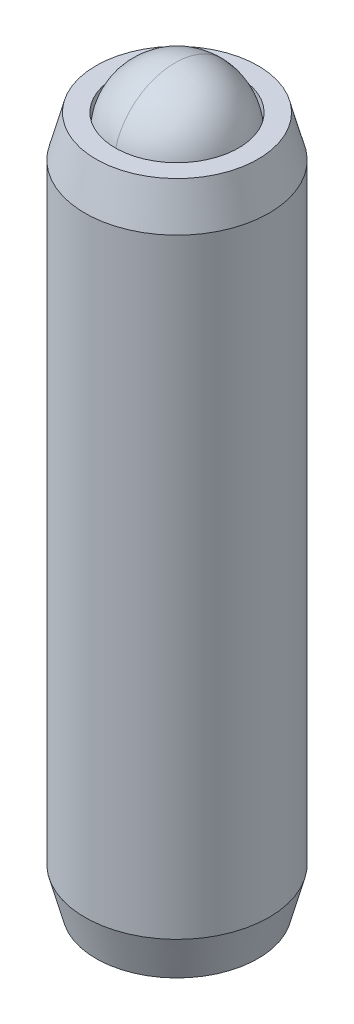
ISO-10303-21;
HEADER;
FILE_DESCRIPTION(('STEP AP214'),'2;1');
FILE_NAME('part.step','',(''),(''),'','','');
FILE_SCHEMA(('AUTOMOTIVE_DESIGN { 1 0 10303 214 1 1 1 1 }'));
ENDSEC;
DATA;
#1=APPLICATION_CONTEXT('core data for automotive mechanical design processes');
#2=APPLICATION_PROTOCOL_DEFINITION('international standard','automotive_design',2000,#1);
#3=PRODUCT_CONTEXT('',#1,'mechanical');
#4=PRODUCT('Part','Part','',(#3));
#5=PRODUCT_RELATED_PRODUCT_CATEGORY('part','',(#4));
#6=PRODUCT_DEFINITION_FORMATION('','',#4);
#7=PRODUCT_DEFINITION_CONTEXT('part definition',#1,'design');
#8=PRODUCT_DEFINITION('design','',#6,#7);
#9=PRODUCT_DEFINITION_SHAPE('','',#8);
#10=(LENGTH_UNIT() NAMED_UNIT(*) SI_UNIT(.MILLI.,.METRE.));
#11=(NAMED_UNIT(*) PLANE_ANGLE_UNIT() SI_UNIT($,.RADIAN.));
#12=(NAMED_UNIT(*) SI_UNIT($,.STERADIAN.) SOLID_ANGLE_UNIT());
#13=UNCERTAINTY_MEASURE_WITH_UNIT(LENGTH_MEASURE(1.E-05),#10,'distance_accuracy_value','');
#14=(GEOMETRIC_REPRESENTATION_CONTEXT(3) GLOBAL_UNCERTAINTY_ASSIGNED_CONTEXT((#13)) GLOBAL_UNIT_ASSIGNED_CONTEXT((#10,
#11,#12)) REPRESENTATION_CONTEXT('',''));
#15=CARTESIAN_POINT('',(0.,0.,0.));
#16=DIRECTION('',(0.,0.,1.));
#17=DIRECTION('',(1.,0.,0.));
#18=AXIS2_PLACEMENT_3D('',#15,#16,#17);
#19=CARTESIAN_POINT('',(4.50104004973347,0.0968381595625629,16.0605062861475));
#20=DIRECTION('',(0.,-1.,0.));
#21=DIRECTION('',(1.,0.,0.));
#22=AXIS2_PLACEMENT_3D('',#19,#20,#21);
#23=CONICAL_SURFACE('',#22,0.,0.78539816339745);
#24=CARTESIAN_POINT('',(4.50104004973347,-1.04616184043743,16.0605062861475));
#25=DIRECTION('',(0.,1.,0.));
#26=DIRECTION('',(-1.,0.,0.));
#27=AXIS2_PLACEMENT_3D('',#24,#25,#26);
#28=CIRCLE('',#27,1.143);
#29=CARTESIAN_POINT('',(5.64403056105932,-1.04616184043744,16.0558489243331));
#30=VERTEX_POINT('',#29);
#31=CARTESIAN_POINT('',(5.07656869904236,-1.04616184043744,15.072976147962));
#32=VERTEX_POINT('',#31);
#33=EDGE_CURVE('P0_E239',#30,#32,#28,.T.);
#34=ORIENTED_EDGE('',*,*,#33,.F.);
#35=CARTESIAN_POINT('',(5.64424004973347,-1.04636990674664,16.0562117693603));
#36=CARTESIAN_POINT('',(5.64423734331213,-1.04636721795394,16.056207081701));
#37=CARTESIAN_POINT('',(5.64423463688488,-1.04636452918421,16.0562023940315));
#38=CARTESIAN_POINT('',(5.62474230659186,-1.02699958015214,16.0224406876069));
#39=CARTESIAN_POINT('',(5.60494621032366,-1.00882817605903,15.9881528430783));
#40=CARTESIAN_POINT('',(5.56468487257203,-0.975628295113757,15.9184181605113));
#41=CARTESIAN_POINT('',(5.54421926404791,-0.960601576800141,15.8829706867399));
#42=CARTESIAN_POINT('',(5.50268828153905,-0.934657838003665,15.8110369149464));
#43=CARTESIAN_POINT('',(5.48162454180984,-0.923730597372619,15.774553447538));
#44=CARTESIAN_POINT('',(5.43900618235622,-0.906894066374367,15.700736283629));
#45=CARTESIAN_POINT('',(5.41745210190168,-0.900979513390817,15.6634035211713));
#46=CARTESIAN_POINT('',(5.3802778828564,-0.895669150819836,15.5990158850532));
#47=CARTESIAN_POINT('',(5.36470503634171,-0.894902048946091,15.5720429236713));
#48=CARTESIAN_POINT('',(5.33359085125451,-0.896297925620096,15.5181515742642));
#49=CARTESIAN_POINT('',(5.31804952017328,-0.898461533958299,15.4912331992142));
#50=CARTESIAN_POINT('',(5.27164059573856,-0.909204050609727,15.4108505841687));
#51=CARTESIAN_POINT('',(5.24100595359908,-0.922037014959776,15.3577898275114));
#52=CARTESIAN_POINT('',(5.18779705685995,-0.952662080254808,15.2656293149446));
#53=CARTESIAN_POINT('',(5.16495082410589,-0.968706205095023,15.226058479053));
#54=CARTESIAN_POINT('',(5.12006763957073,-1.00479690147797,15.1483185230326));
#55=CARTESIAN_POINT('',(5.09803078425179,-1.02484394827083,15.1101495699811));
#56=CARTESIAN_POINT('',(5.05494475657881,-1.06764046961955,15.0355223809552));
#57=CARTESIAN_POINT('',(5.03388732651376,-1.09035741661059,14.9990498422057));
#58=CARTESIAN_POINT('',(4.99246293845225,-1.13788092174395,14.9273006974107));
#59=CARTESIAN_POINT('',(4.97209385691844,-1.16268003309501,14.8920204132907));
#60=CARTESIAN_POINT('',(4.95197727397306,-1.18820838474931,14.8571774695546));
#61=B_SPLINE_CURVE_WITH_KNOTS('',3,(#35,#36,#37,#38,#39,#40,#41,#42,#43,#44,#45,#46,#47,#48,#49,
#50,#51,#52,#53,#54,#55,#56,#57,#58,#59,#60),.UNSPECIFIED.,.F.,.F.,(4,2,2,2,2,2,2,2,2,2,2,2,4),
(0.,1.81316377693155E-05,0.130588066150726,0.261230822661013,0.391545682806475,
0.521723560618479,0.615053768986422,0.708404036587752,0.895210399439812,1.04029045702021,
1.18538774959988,1.32887166801433,1.47186265945493),.UNSPECIFIED.);
#62=EDGE_CURVE('P0_E11',#30,#32,#61,.T.);
#63=ORIENTED_EDGE('',*,*,#62,.T.);
#64=EDGE_LOOP('',(#34,#63));
#65=FACE_BOUND('',#64,.T.);
#66=ADVANCED_FACE('P0_F17',(#65),#23,.F.);
#67=CARTESIAN_POINT('',(5.06850191175043,-1.04616184043744,15.0683187861475));
#68=VERTEX_POINT('',#67);
#69=CARTESIAN_POINT('',(3.93357818771651,-1.04616184043744,15.0683187861475));
#70=VERTEX_POINT('',#69);
#71=EDGE_CURVE('P0_E243',#68,#70,#28,.T.);
#72=ORIENTED_EDGE('',*,*,#71,.F.);
#73=CARTESIAN_POINT('',(3.36040924209636,-1.41494048643265,15.0683187861475));
#74=CARTESIAN_POINT('',(3.38819120875312,-1.39398230038489,15.0683187861475));
#75=CARTESIAN_POINT('',(3.41612817609048,-1.37323015913734,15.0683187861475));
#76=CARTESIAN_POINT('',(3.47237492683402,-1.33222302202394,15.0683187861475));
#77=CARTESIAN_POINT('',(3.50068480162547,-1.31196815163866,15.0683187861475));
#78=CARTESIAN_POINT('',(3.5866824858943,-1.25178803103109,15.0683187861475));
#79=CARTESIAN_POINT('',(3.64501593192254,-1.21277008893004,15.0683187861475));
#80=CARTESIAN_POINT('',(3.76732701105839,-1.13619006643763,15.0683187861475));
#81=CARTESIAN_POINT('',(3.83143697439802,-1.09883692997709,15.0683187861475));
#82=CARTESIAN_POINT('',(3.9628566935852,-1.03052186543194,15.0683187861475));
#83=CARTESIAN_POINT('',(4.03015468378982,-0.999538394109551,15.0683187861475));
#84=CARTESIAN_POINT('',(4.13118728129897,-0.961633549999899,15.0683187861475));
#85=CARTESIAN_POINT('',(4.163429997488,-0.95075150823264,15.0683187861475));
#86=CARTESIAN_POINT('',(4.22869221812758,-0.931576209222496,15.0683187861475));
#87=CARTESIAN_POINT('',(4.26171177607779,-0.923283130841316,15.0683187861475));
#88=CARTESIAN_POINT('',(4.3277742404437,-0.909855197961434,15.0683187861475));
#89=CARTESIAN_POINT('',(4.36080590324829,-0.904665888376895,15.0683187861475));
#90=CARTESIAN_POINT('',(4.42723123533273,-0.897543192508195,15.0683187861475));
#91=CARTESIAN_POINT('',(4.46062495949064,-0.89561030694867,15.0683187861475));
#92=CARTESIAN_POINT('',(4.52623433291741,-0.895146391098318,15.0683187861475));
#93=CARTESIAN_POINT('',(4.5584491767744,-0.896495564653912,15.0683187861475));
#94=CARTESIAN_POINT('',(4.62259130425264,-0.902256523706286,15.0683187861475));
#95=CARTESIAN_POINT('',(4.65451865215462,-0.906667606460108,15.0683187861475));
#96=CARTESIAN_POINT('',(4.71841114574275,-0.918386689640513,15.0683187861475));
#97=CARTESIAN_POINT('',(4.75036703871706,-0.925744380415585,15.0683187861475));
#98=CARTESIAN_POINT('',(4.81358083061595,-0.942966153304446,15.0683187861475));
#99=CARTESIAN_POINT('',(4.84483878833594,-0.952830023419651,15.0683187861475));
#100=CARTESIAN_POINT('',(4.94333560417157,-0.987620399443785,15.0683187861475));
#101=CARTESIAN_POINT('',(5.00917031860725,-1.0165126250735,15.0683187861475));
#102=CARTESIAN_POINT('',(5.13774620731225,-1.08074852479713,15.0683187861475));
#103=CARTESIAN_POINT('',(5.20047519452531,-1.1161153941491,15.0683187861475));
#104=CARTESIAN_POINT('',(5.32035806520786,-1.18907771012509,15.0683187861475));
#105=CARTESIAN_POINT('',(5.37763407751855,-1.22647497130157,15.0683187861475));
#106=CARTESIAN_POINT('',(5.46201879507418,-1.28428613939679,15.0683187861475));
#107=CARTESIAN_POINT('',(5.48978279464167,-1.3037601504881,15.0683187861475));
#108=CARTESIAN_POINT('',(5.54493146969836,-1.34322292342068,15.0683187861475));
#109=CARTESIAN_POINT('',(5.57231624683141,-1.36321154305626,15.0683187861475));
#110=CARTESIAN_POINT('',(5.59954313391973,-1.38341352887524,15.0683187861475));
#111=B_SPLINE_CURVE_WITH_KNOTS('',3,(#73,#74,#75,#76,#77,#78,#79,#80,#81,#82,#83,#84,#85,#86,
#87,#88,#89,#90,#91,#92,#93,#94,#95,#96,#97,#98,#99,#100,#101,#102,#103,#104,#105,#106,#107,
#108,#109,#110),.UNSPECIFIED.,.F.,.F.,(4,2,2,2,2,2,2,2,2,2,2,2,2,2,2,2,2,2,4),(0.,
0.104399205750145,0.20882449015393,0.4192690376076,0.641680044169886,0.863325974887583,
0.965328311414919,1.06733769333986,1.16750041530699,1.26767853740811,1.3642553320756,
1.46080996859686,1.55906646638461,1.65731465538659,1.87236816316002,2.08820773237251,
2.29331760239731,2.39505206150512,2.49675870307945),.UNSPECIFIED.);
#112=EDGE_CURVE('P0_E30',#68,#70,#111,.F.);
#113=ORIENTED_EDGE('',*,*,#112,.T.);
#114=EDGE_LOOP('',(#72,#113));
#115=FACE_BOUND('',#114,.T.);
#116=ADVANCED_FACE('P0_F230',(#115),#23,.F.);
#117=CARTESIAN_POINT('',(3.92551140042457,-1.04616184043744,15.072976147962));
#118=VERTEX_POINT('',#117);
#119=CARTESIAN_POINT('',(3.35804953840762,-1.04616184043744,16.055848924333));
#120=VERTEX_POINT('',#119);
#121=EDGE_CURVE('P0_E162',#118,#120,#28,.T.);
#122=ORIENTED_EDGE('',*,*,#121,.F.);
#123=CARTESIAN_POINT('',(4.05010282549388,-1.18820838474931,14.8571774695546));
#124=CARTESIAN_POINT('',(4.03012507233774,-1.1628546948407,14.8917799530421));
#125=CARTESIAN_POINT('',(4.00989593040655,-1.13821948711075,14.9268178546604));
#126=CARTESIAN_POINT('',(3.96847838685437,-1.09066594359066,14.9985551444175));
#127=CARTESIAN_POINT('',(3.94727946845226,-1.06778444657524,15.0352727481555));
#128=CARTESIAN_POINT('',(3.90613935102516,-1.02691919654286,15.1065295217686));
#129=CARTESIAN_POINT('',(3.88626299376791,-1.0086782326838,15.1409563824075));
#130=CARTESIAN_POINT('',(3.84583952919616,-0.97537416177773,15.2109718768637));
#131=CARTESIAN_POINT('',(3.82529229482316,-0.960311660783733,15.2465607307528));
#132=CARTESIAN_POINT('',(3.7837555777016,-0.934435083863783,15.318504435187));
#133=CARTESIAN_POINT('',(3.76277274588945,-0.923579230725583,15.3548477659723));
#134=CARTESIAN_POINT('',(3.72031898634989,-0.906847776266648,15.4283798344671));
#135=CARTESIAN_POINT('',(3.69884854515331,-0.900967416853876,15.4655677294805));
#136=CARTESIAN_POINT('',(3.66176969014412,-0.895670746720335,15.5297901902429));
#137=CARTESIAN_POINT('',(3.64620788206009,-0.89490311812614,15.5567440325021));
#138=CARTESIAN_POINT('',(3.6151156296657,-0.896293896802702,15.6105973933709));
#139=CARTESIAN_POINT('',(3.59958519268263,-0.898452922790031,15.6374968992893));
#140=CARTESIAN_POINT('',(3.55316494449615,-0.909185897048029,15.7178991276483));
#141=CARTESIAN_POINT('',(3.5225086902031,-0.922024020914427,15.7709973176536));
#142=CARTESIAN_POINT('',(3.4692915962796,-0.952654498126159,15.8631720281603));
#143=CARTESIAN_POINT('',(3.4464578021495,-0.968688748965755,15.9027213197232));
#144=CARTESIAN_POINT('',(3.41280236224527,-0.995745851204143,15.9610142515884));
#145=CARTESIAN_POINT('',(3.40167440054682,-1.00527469614421,15.9802884466348));
#146=CARTESIAN_POINT('',(3.37961638005773,-1.02519947132574,16.0184940588363));
#147=CARTESIAN_POINT('',(3.36868629611363,-1.03559529040534,16.0374255195584));
#148=CARTESIAN_POINT('',(3.3346079398378,-1.069448586692,16.0964509640666));
#149=CARTESIAN_POINT('',(3.31179053151448,-1.09423996708009,16.1359718745796));
#150=CARTESIAN_POINT('',(3.26686319641098,-1.14628190722223,16.2137883016276));
#151=CARTESIAN_POINT('',(3.24475369706318,-1.17353391612872,16.2520830778279));
#152=CARTESIAN_POINT('',(3.20105316811363,-1.22991734799787,16.3277746142861));
#153=CARTESIAN_POINT('',(3.17946386092026,-1.25905407943452,16.3651683912453));
#154=CARTESIAN_POINT('',(3.13675684645933,-1.31868307382359,16.4391391101312));
#155=CARTESIAN_POINT('',(3.11563921318518,-1.34917554724391,16.4757159238976));
#156=CARTESIAN_POINT('',(3.05412897135291,-1.44029436997072,16.5822547879369));
#157=CARTESIAN_POINT('',(3.01425850558773,-1.50232859955464,16.6513124603637));
#158=CARTESIAN_POINT('',(2.95532139092553,-1.59691790326216,16.7533945374101));
#159=CARTESIAN_POINT('',(2.9358911505621,-1.6285833629406,16.7870487009228));
#160=CARTESIAN_POINT('',(2.89723489981835,-1.69239387155854,16.8540032912412));
#161=CARTESIAN_POINT('',(2.87800884949882,-1.72453882363823,16.8873037872234));
#162=CARTESIAN_POINT('',(2.85886430821701,-1.75687888924048,16.9204631054111));
#163=B_SPLINE_CURVE_WITH_KNOTS('',3,(#123,#124,#125,#126,#127,#128,#129,#130,#131,#132,#133,
#134,#135,#136,#137,#138,#139,#140,#141,#142,#143,#144,#145,#146,#147,#148,#149,#150,#151,#152,
#153,#154,#155,#156,#157,#158,#159,#160,#161,#162),.UNSPECIFIED.,.F.,.F.,(4,2,2,2,2,2,2,2,2,2,2,
2,2,2,2,2,2,2,2,4),(0.,0.142015492124799,0.286474785804309,0.417582578490737,0.548715347595036,
0.678510217108262,0.808180822332907,0.901445197909846,0.994729293345564,1.1816673175961,
1.32665810540211,1.39927013153265,1.47187286175303,1.62755511883544,1.78332966839057,
1.93956387642129,2.09582242380832,2.39881912123288,2.54920251539601,2.69955593206452),.UNSPECIFIED.);
#164=EDGE_CURVE('P0_E256',#118,#120,#163,.T.);
#165=ORIENTED_EDGE('',*,*,#164,.T.);
#166=EDGE_LOOP('',(#122,#165));
#167=FACE_BOUND('',#166,.T.);
#168=ADVANCED_FACE('P0_F235',(#167),#23,.F.);
#169=CARTESIAN_POINT('',(3.35804953840762,-1.04616184043744,16.065163647962));
#170=VERTEX_POINT('',#169);
#171=CARTESIAN_POINT('',(3.92551140042457,-1.04616184043744,17.0480364243331));
#172=VERTEX_POINT('',#171);
#173=EDGE_CURVE('P0_E173',#170,#172,#28,.T.);
#174=ORIENTED_EDGE('',*,*,#173,.F.);
#175=CARTESIAN_POINT('',(3.35784004973347,-1.04636990674664,16.0648008029348));
#176=CARTESIAN_POINT('',(3.35784275615481,-1.04636721795394,16.0648054905941));
#177=CARTESIAN_POINT('',(3.35784546258205,-1.04636452918421,16.0648101782636));
#178=CARTESIAN_POINT('',(3.37733779287397,-1.02699958015532,16.098571884691));
#179=CARTESIAN_POINT('',(3.39713388914319,-1.0088281760597,16.1328597292179));
#180=CARTESIAN_POINT('',(3.43739522689564,-0.975628295112563,16.2025944117838));
#181=CARTESIAN_POINT('',(3.45786083541957,-0.960601576799585,16.2380418855558));
#182=CARTESIAN_POINT('',(3.49939181792818,-0.934657838003693,16.3099756573495));
#183=CARTESIAN_POINT('',(3.52045555765734,-0.923730597372563,16.3464591247577));
#184=CARTESIAN_POINT('',(3.56307391711083,-0.906894066374279,16.4202762886662));
#185=CARTESIAN_POINT('',(3.58462799756531,-0.900979513390798,16.4576090511238));
#186=CARTESIAN_POINT('',(3.62180221661048,-0.895669150819854,16.5219966872418));
#187=CARTESIAN_POINT('',(3.63737506312512,-0.894902048946098,16.5489696486236));
#188=CARTESIAN_POINT('',(3.66848924821223,-0.896297925620074,16.6028609980306));
#189=CARTESIAN_POINT('',(3.6840305792934,-0.898461533958257,16.6297793730804));
#190=CARTESIAN_POINT('',(3.73043950372818,-0.909204050609646,16.7101619881261));
#191=CARTESIAN_POINT('',(3.76107414586776,-0.922037014959721,16.7632227447835));
#192=CARTESIAN_POINT('',(3.81428304260701,-0.952662080254825,16.8553832573506));
#193=CARTESIAN_POINT('',(3.83712927536111,-0.968706205095066,16.8949540932422));
#194=CARTESIAN_POINT('',(3.88201245989627,-1.00479690147802,16.9726940492626));
#195=CARTESIAN_POINT('',(3.90404931521517,-1.02484394827086,17.010863002314));
#196=CARTESIAN_POINT('',(3.94713534288809,-1.06764046961952,17.0854901913398));
#197=CARTESIAN_POINT('',(3.96819277295311,-1.09035741661052,17.1219627300893));
#198=CARTESIAN_POINT('',(4.00961716101463,-1.13788092174388,17.1937118748842));
#199=CARTESIAN_POINT('',(4.02998624254846,-1.16268003309497,17.2289921590044));
#200=CARTESIAN_POINT('',(4.05010282549388,-1.18820838474931,17.2638351027405));
#201=B_SPLINE_CURVE_WITH_KNOTS('',3,(#175,#176,#177,#178,#179,#180,#181,#182,#183,#184,#185,
#186,#187,#188,#189,#190,#191,#192,#193,#194,#195,#196,#197,#198,#199,#200),.UNSPECIFIED.,.F.,
.F.,(4,2,2,2,2,2,2,2,2,2,2,2,4),(0.,1.81316377723949E-05,0.130588066151501,0.26123082266207,
0.391545682806769,0.521723560618479,0.615053768986128,0.708404036587149,0.895210399439813,
1.04029045702041,1.18538774959988,1.32887166801411,1.47186265945493),.UNSPECIFIED.);
#202=EDGE_CURVE('P0_E258',#170,#172,#201,.T.);
#203=ORIENTED_EDGE('',*,*,#202,.T.);
#204=EDGE_LOOP('',(#174,#203));
#205=FACE_BOUND('',#204,.T.);
#206=ADVANCED_FACE('P0_F292',(#205),#23,.F.);
#207=CARTESIAN_POINT('',(3.93357818771651,-1.04616184043744,17.0526937861475));
#208=VERTEX_POINT('',#207);
#209=CARTESIAN_POINT('',(5.06850191175043,-1.04616184043744,17.0526937861475));
#210=VERTEX_POINT('',#209);
#211=EDGE_CURVE('P0_E177',#208,#210,#28,.T.);
#212=ORIENTED_EDGE('',*,*,#211,.F.);
#213=CARTESIAN_POINT('',(3.36040924209636,-1.41494048643265,17.0526937861475));
#214=CARTESIAN_POINT('',(3.38819120875312,-1.39398230038489,17.0526937861475));
#215=CARTESIAN_POINT('',(3.41612817609048,-1.37323015913734,17.0526937861475));
#216=CARTESIAN_POINT('',(3.47237492683402,-1.33222302202394,17.0526937861475));
#217=CARTESIAN_POINT('',(3.50068480162547,-1.31196815163866,17.0526937861475));
#218=CARTESIAN_POINT('',(3.5866824858943,-1.25178803103109,17.0526937861475));
#219=CARTESIAN_POINT('',(3.64501593192254,-1.21277008893004,17.0526937861475));
#220=CARTESIAN_POINT('',(3.76732701105839,-1.13619006643763,17.0526937861475));
#221=CARTESIAN_POINT('',(3.83143697439802,-1.09883692997709,17.0526937861475));
#222=CARTESIAN_POINT('',(3.9628566935852,-1.03052186543194,17.0526937861475));
#223=CARTESIAN_POINT('',(4.03015468378982,-0.999538394109552,17.0526937861475));
#224=CARTESIAN_POINT('',(4.13118728129897,-0.961633549999899,17.0526937861475));
#225=CARTESIAN_POINT('',(4.163429997488,-0.950751508232639,17.0526937861475));
#226=CARTESIAN_POINT('',(4.22869221812758,-0.931576209222495,17.0526937861475));
#227=CARTESIAN_POINT('',(4.26171177607779,-0.923283130841314,17.0526937861475));
#228=CARTESIAN_POINT('',(4.32777424044369,-0.909855197961433,17.0526937861475));
#229=CARTESIAN_POINT('',(4.36080590324829,-0.904665888376892,17.0526937861475));
#230=CARTESIAN_POINT('',(4.42723123533273,-0.897543192508194,17.0526937861475));
#231=CARTESIAN_POINT('',(4.46062495949064,-0.89561030694867,17.0526937861475));
#232=CARTESIAN_POINT('',(4.52623433291741,-0.895146391098318,17.0526937861475));
#233=CARTESIAN_POINT('',(4.5584491767744,-0.896495564653911,17.0526937861475));
#234=CARTESIAN_POINT('',(4.62259130425264,-0.902256523706284,17.0526937861475));
#235=CARTESIAN_POINT('',(4.65451865215462,-0.906667606460107,17.0526937861475));
#236=CARTESIAN_POINT('',(4.71841114574275,-0.918386689640512,17.0526937861475));
#237=CARTESIAN_POINT('',(4.75036703871706,-0.925744380415583,17.0526937861475));
#238=CARTESIAN_POINT('',(4.81358083061595,-0.942966153304444,17.0526937861475));
#239=CARTESIAN_POINT('',(4.84483878833594,-0.952830023419651,17.0526937861475));
#240=CARTESIAN_POINT('',(4.94333560417157,-0.987620399443786,17.0526937861475));
#241=CARTESIAN_POINT('',(5.00917031860725,-1.01651262507349,17.0526937861475));
#242=CARTESIAN_POINT('',(5.13774620731225,-1.08074852479713,17.0526937861475));
#243=CARTESIAN_POINT('',(5.20047519452531,-1.1161153941491,17.0526937861475));
#244=CARTESIAN_POINT('',(5.32035806520786,-1.18907771012509,17.0526937861475));
#245=CARTESIAN_POINT('',(5.37763407751855,-1.22647497130157,17.0526937861475));
#246=CARTESIAN_POINT('',(5.46201879507418,-1.28428613939679,17.0526937861475));
#247=CARTESIAN_POINT('',(5.48978279464167,-1.30376015048809,17.0526937861475));
#248=CARTESIAN_POINT('',(5.54493146969836,-1.34322292342068,17.0526937861475));
#249=CARTESIAN_POINT('',(5.57231624683141,-1.36321154305626,17.0526937861475));
#250=CARTESIAN_POINT('',(5.59954313391973,-1.38341352887524,17.0526937861475));
#251=B_SPLINE_CURVE_WITH_KNOTS('',3,(#213,#214,#215,#216,#217,#218,#219,#220,#221,#222,#223,
#224,#225,#226,#227,#228,#229,#230,#231,#232,#233,#234,#235,#236,#237,#238,#239,#240,#241,#242,
#243,#244,#245,#246,#247,#248,#249,#250),.UNSPECIFIED.,.F.,.F.,(4,2,2,2,2,2,2,2,2,2,2,2,2,2,2,2,
2,2,4),(0.,0.104399205750145,0.20882449015393,0.4192690376076,0.641680044169886,
0.863325974887584,0.96532831141492,1.06733769333986,1.16750041530699,1.26767853740811,
1.3642553320756,1.46080996859686,1.55906646638461,1.65731465538659,1.87236816316003,
2.08820773237251,2.29331760239731,2.39505206150512,2.49675870307945),.UNSPECIFIED.);
#252=EDGE_CURVE('P0_E201',#208,#210,#251,.T.);
#253=ORIENTED_EDGE('',*,*,#252,.T.);
#254=EDGE_LOOP('',(#212,#253));
#255=FACE_BOUND('',#254,.T.);
#256=ADVANCED_FACE('P0_F228',(#255),#23,.F.);
#257=CARTESIAN_POINT('',(4.50104004973347,15.7587741292953,16.0605062861475));
#258=DIRECTION('',(0.,1.,0.));
#259=DIRECTION('',(-1.,0.,0.));
#260=AXIS2_PLACEMENT_3D('',#257,#258,#259);
#261=CONICAL_SURFACE('',#260,1.59385,0.785398163397443);
#262=CARTESIAN_POINT('',(4.50104004973347,14.1649241292953,16.0605062861475));
#263=VERTEX_POINT('',#262);
#264=VERTEX_LOOP('',#263);
#265=FACE_BOUND('',#264,.T.);
#266=CARTESIAN_POINT('',(4.50104004973347,15.7587741292953,16.0605062861475));
#267=DIRECTION('',(0.,1.,0.));
#268=DIRECTION('',(-1.,0.,0.));
#269=AXIS2_PLACEMENT_3D('',#266,#267,#268);
#270=CIRCLE('',#269,1.59385);
#271=CARTESIAN_POINT('',(2.90719004973346,15.7587741292953,16.0605062861475));
#272=VERTEX_POINT('',#271);
#273=EDGE_CURVE('P0_E192',#272,#272,#270,.T.);
#274=ORIENTED_EDGE('',*,*,#273,.T.);
#275=EDGE_LOOP('',(#274));
#276=FACE_BOUND('',#275,.T.);
#277=ADVANCED_FACE('P0_F19',(#265,#276),#261,.F.);
#278=CARTESIAN_POINT('',(4.50104004973347,14.1649241292953,16.0605062861475));
#279=DIRECTION('',(0.,1.,0.));
#280=DIRECTION('',(-1.,0.,0.));
#281=AXIS2_PLACEMENT_3D('',#278,#279,#280);
#282=CYLINDRICAL_SURFACE('',#281,1.59385);
#283=ORIENTED_EDGE('',*,*,#273,.F.);
#284=EDGE_LOOP('',(#283));
#285=FACE_BOUND('',#284,.T.);
#286=CARTESIAN_POINT('',(4.50104004973347,16.8608381595626,16.0605062861475));
#287=DIRECTION('',(0.,1.,0.));
#288=DIRECTION('',(-1.,0.,0.));
#289=AXIS2_PLACEMENT_3D('',#286,#287,#288);
#290=CIRCLE('',#289,1.59385);
#291=CARTESIAN_POINT('',(2.90719004973346,16.8608381595626,16.0605062861475));
#292=VERTEX_POINT('',#291);
#293=EDGE_CURVE('P0_E189',#292,#292,#290,.T.);
#294=ORIENTED_EDGE('',*,*,#293,.T.);
#295=EDGE_LOOP('',(#294));
#296=FACE_BOUND('',#295,.T.);
#297=ADVANCED_FACE('P0_F337',(#285,#296),#282,.F.);
#298=CARTESIAN_POINT('',(6.09489004973347,16.8608381595626,16.0605062861475));
#299=DIRECTION('',(0.,-1.,0.));
#300=DIRECTION('',(1.,0.,0.));
#301=AXIS2_PLACEMENT_3D('',#298,#299,#300);
#302=PLANE('',#301);
#303=ORIENTED_EDGE('',*,*,#293,.F.);
#304=EDGE_LOOP('',(#303));
#305=FACE_BOUND('',#304,.T.);
#306=CARTESIAN_POINT('',(4.50104004973347,16.8608381595626,16.0605062861475));
#307=DIRECTION('',(0.,1.,0.));
#308=DIRECTION('',(-1.,0.,0.));
#309=AXIS2_PLACEMENT_3D('',#306,#307,#308);
#310=CIRCLE('',#309,2.0955);
#311=CARTESIAN_POINT('',(2.40554004973346,16.8608381595626,16.0605062861475));
#312=VERTEX_POINT('',#311);
#313=EDGE_CURVE('P0_E186',#312,#312,#310,.T.);
#314=ORIENTED_EDGE('',*,*,#313,.T.);
#315=EDGE_LOOP('',(#314));
#316=FACE_BOUND('',#315,.T.);
#317=ADVANCED_FACE('P0_F344',(#305,#316),#302,.F.);
#318=CARTESIAN_POINT('',(4.50104004973347,15.7944046412998,16.0605062861475));
#319=DIRECTION('',(0.,-1.,0.));
#320=DIRECTION('',(1.,0.,0.));
#321=AXIS2_PLACEMENT_3D('',#318,#319,#320);
#322=CONICAL_SURFACE('',#321,2.38125,0.261799387799151);
#323=ORIENTED_EDGE('',*,*,#313,.F.);
#324=EDGE_LOOP('',(#323));
#325=FACE_BOUND('',#324,.T.);
#326=CARTESIAN_POINT('',(4.50104004973347,15.7944046412998,16.0605062861475));
#327=DIRECTION('',(0.,1.,0.));
#328=DIRECTION('',(-1.,0.,0.));
#329=AXIS2_PLACEMENT_3D('',#326,#327,#328);
#330=CIRCLE('',#329,2.38125);
#331=CARTESIAN_POINT('',(2.11979004973347,15.7944046412998,16.0605062861475));
#332=VERTEX_POINT('',#331);
#333=EDGE_CURVE('P0_E183',#332,#332,#330,.T.);
#334=ORIENTED_EDGE('',*,*,#333,.T.);
#335=EDGE_LOOP('',(#334));
#336=FACE_BOUND('',#335,.T.);
#337=ADVANCED_FACE('P0_F352',(#325,#336),#322,.T.);
#338=CARTESIAN_POINT('',(4.50104004973347,14.1649241292953,16.0605062861475));
#339=DIRECTION('',(0.,1.,0.));
#340=DIRECTION('',(-1.,0.,0.));
#341=AXIS2_PLACEMENT_3D('',#338,#339,#340);
#342=CYLINDRICAL_SURFACE('',#341,2.38125);
#343=ORIENTED_EDGE('',*,*,#333,.F.);
#344=EDGE_LOOP('',(#343));
#345=FACE_BOUND('',#344,.T.);
#346=CARTESIAN_POINT('',(4.50104004973347,0.0202716778253693,16.0605062861475));
#347=DIRECTION('',(0.,1.,0.));
#348=DIRECTION('',(-1.,0.,0.));
#349=AXIS2_PLACEMENT_3D('',#346,#347,#348);
#350=CIRCLE('',#349,2.38125);
#351=CARTESIAN_POINT('',(2.11979004973347,0.020271677825369,16.0605062861475));
#352=VERTEX_POINT('',#351);
#353=EDGE_CURVE('P0_E180',#352,#352,#350,.T.);
#354=ORIENTED_EDGE('',*,*,#353,.T.);
#355=EDGE_LOOP('',(#354));
#356=FACE_BOUND('',#355,.T.);
#357=ADVANCED_FACE('P0_F361',(#345,#356),#342,.T.);
#358=CARTESIAN_POINT('',(4.50104004973347,-1.04616184043744,16.0605062861475));
#359=DIRECTION('',(0.,1.,0.));
#360=DIRECTION('',(-1.,0.,0.));
#361=AXIS2_PLACEMENT_3D('',#358,#359,#360);
#362=CONICAL_SURFACE('',#361,2.0955,0.26179938779915);
#363=ORIENTED_EDGE('',*,*,#353,.F.);
#364=EDGE_LOOP('',(#363));
#365=FACE_BOUND('',#364,.T.);
#366=CARTESIAN_POINT('',(4.50104004973347,-1.04616184043744,16.0605062861475));
#367=DIRECTION('',(0.,1.,0.));
#368=DIRECTION('',(-1.,0.,0.));
#369=AXIS2_PLACEMENT_3D('',#366,#367,#368);
#370=CIRCLE('',#369,2.0955);
#371=CARTESIAN_POINT('',(2.40554004973347,-1.04616184043744,16.0605062861475));
#372=VERTEX_POINT('',#371);
#373=EDGE_CURVE('P0_E176',#372,#372,#370,.T.);
#374=ORIENTED_EDGE('',*,*,#373,.T.);
#375=EDGE_LOOP('',(#374));
#376=FACE_BOUND('',#375,.T.);
#377=ADVANCED_FACE('P0_F370',(#365,#376),#362,.T.);
#378=CARTESIAN_POINT('',(6.59654004973347,-1.04616184043744,16.0605062861475));
#379=DIRECTION('',(0.,1.,0.));
#380=DIRECTION('',(-1.,0.,0.));
#381=AXIS2_PLACEMENT_3D('',#378,#379,#380);
#382=PLANE('',#381);
#383=ORIENTED_EDGE('',*,*,#373,.F.);
#384=EDGE_LOOP('',(#383));
#385=FACE_BOUND('',#384,.T.);
#386=ORIENTED_EDGE('',*,*,#33,.T.);
#387=DIRECTION('',(0.5,0.,0.866025403784439));
#388=VECTOR('',#387,1.);
#389=CARTESIAN_POINT('',(5.07387976994505,-1.04616184043744,15.0683187861475));
#390=LINE('',#389,#388);
#391=CARTESIAN_POINT('',(5.07387976994505,-1.04616184043744,15.0683187861475));
#392=VERTEX_POINT('',#391);
#393=EDGE_CURVE('P0_E147',#392,#32,#390,.T.);
#394=ORIENTED_EDGE('',*,*,#393,.F.);
#395=DIRECTION('',(1.,0.,0.));
#396=VECTOR('',#395,1.);
#397=CARTESIAN_POINT('',(3.92820032952189,-1.04616184043744,15.0683187861475));
#398=LINE('',#397,#396);
#399=EDGE_CURVE('P0_E137',#68,#392,#398,.T.);
#400=ORIENTED_EDGE('',*,*,#399,.F.);
#401=ORIENTED_EDGE('',*,*,#71,.T.);
#402=CARTESIAN_POINT('',(3.92820032952189,-1.04616184043744,15.0683187861475));
#403=VERTEX_POINT('',#402);
#404=EDGE_CURVE('P0_E135',#403,#70,#398,.T.);
#405=ORIENTED_EDGE('',*,*,#404,.F.);
#406=DIRECTION('',(0.5,0.,-0.866025403784439));
#407=VECTOR('',#406,1.);
#408=CARTESIAN_POINT('',(3.3553606093103,-1.04616184043744,16.0605062861475));
#409=LINE('',#408,#407);
#410=EDGE_CURVE('P0_E157',#118,#403,#409,.T.);
#411=ORIENTED_EDGE('',*,*,#410,.F.);
#412=ORIENTED_EDGE('',*,*,#121,.T.);
#413=CARTESIAN_POINT('',(3.3553606093103,-1.04616184043744,16.0605062861475));
#414=VERTEX_POINT('',#413);
#415=EDGE_CURVE('P0_E158',#414,#120,#409,.T.);
#416=ORIENTED_EDGE('',*,*,#415,.F.);
#417=DIRECTION('',(-0.5,0.,-0.866025403784439));
#418=VECTOR('',#417,1.);
#419=CARTESIAN_POINT('',(3.92820032952189,-1.04616184043744,17.0526937861475));
#420=LINE('',#419,#418);
#421=EDGE_CURVE('P0_E154',#170,#414,#420,.T.);
#422=ORIENTED_EDGE('',*,*,#421,.F.);
#423=ORIENTED_EDGE('',*,*,#173,.T.);
#424=CARTESIAN_POINT('',(3.92820032952189,-1.04616184043744,17.0526937861475));
#425=VERTEX_POINT('',#424);
#426=EDGE_CURVE('P0_E155',#425,#172,#420,.T.);
#427=ORIENTED_EDGE('',*,*,#426,.F.);
#428=DIRECTION('',(-1.,0.,0.));
#429=VECTOR('',#428,1.);
#430=CARTESIAN_POINT('',(5.07387976994505,-1.04616184043744,17.0526937861475));
#431=LINE('',#430,#429);
#432=EDGE_CURVE('P0_E151',#208,#425,#431,.T.);
#433=ORIENTED_EDGE('',*,*,#432,.F.);
#434=ORIENTED_EDGE('',*,*,#211,.T.);
#435=CARTESIAN_POINT('',(5.07387976994505,-1.04616184043744,17.0526937861475));
#436=VERTEX_POINT('',#435);
#437=EDGE_CURVE('P0_E152',#436,#210,#431,.T.);
#438=ORIENTED_EDGE('',*,*,#437,.F.);
#439=DIRECTION('',(-0.5,0.,0.866025403784438));
#440=VECTOR('',#439,1.);
#441=CARTESIAN_POINT('',(5.64671949015663,-1.04616184043744,16.0605062861475));
#442=LINE('',#441,#440);
#443=CARTESIAN_POINT('',(5.07656869904236,-1.04616184043744,17.0480364243331));
#444=VERTEX_POINT('',#443);
#445=EDGE_CURVE('P0_E149',#444,#436,#442,.T.);
#446=ORIENTED_EDGE('',*,*,#445,.F.);
#447=CARTESIAN_POINT('',(5.64403056105932,-1.04616184043743,16.065163647962));
#448=VERTEX_POINT('',#447);
#449=EDGE_CURVE('P0_E242',#444,#448,#28,.T.);
#450=ORIENTED_EDGE('',*,*,#449,.T.);
#451=CARTESIAN_POINT('',(5.64671949015663,-1.04616184043744,16.0605062861475));
#452=VERTEX_POINT('',#451);
#453=EDGE_CURVE('P0_E37',#452,#448,#442,.T.);
#454=ORIENTED_EDGE('',*,*,#453,.F.);
#455=EDGE_CURVE('P0_E119',#30,#452,#390,.T.);
#456=ORIENTED_EDGE('',*,*,#455,.F.);
#457=EDGE_LOOP('',(#386,#394,#400,#401,#405,#411,#412,#416,#422,#423,#427,#433,#434,#438,#446,
#450,#454,#456));
#458=FACE_BOUND('',#457,.T.);
#459=ADVANCED_FACE('P0_F226',(#385,#458),#382,.F.);
#460=ORIENTED_EDGE('',*,*,#449,.F.);
#461=CARTESIAN_POINT('',(4.95197727397306,-1.18820838474931,17.2638351027405));
#462=CARTESIAN_POINT('',(4.97195502712919,-1.1628546948407,17.229232619253));
#463=CARTESIAN_POINT('',(4.99218416906039,-1.13821948711075,17.1941947176346));
#464=CARTESIAN_POINT('',(5.03360171261257,-1.09066594359066,17.1224574278776));
#465=CARTESIAN_POINT('',(5.05480063101468,-1.06778444657524,17.0857398241396));
#466=CARTESIAN_POINT('',(5.09594074844177,-1.02691919654286,17.0144830505265));
#467=CARTESIAN_POINT('',(5.11581710569902,-1.0086782326838,16.9800561898876));
#468=CARTESIAN_POINT('',(5.15624057027077,-0.975374161777729,16.9100406954314));
#469=CARTESIAN_POINT('',(5.17678780464377,-0.960311660783732,16.8744518415423));
#470=CARTESIAN_POINT('',(5.21832452176534,-0.934435083863783,16.8025081371081));
#471=CARTESIAN_POINT('',(5.23930735357748,-0.923579230725583,16.7661648063228));
#472=CARTESIAN_POINT('',(5.28176111311704,-0.906847776266647,16.692632737828));
#473=CARTESIAN_POINT('',(5.30323155431362,-0.900967416853874,16.6554448428146));
#474=CARTESIAN_POINT('',(5.34031040932282,-0.895670746720333,16.5912223820522));
#475=CARTESIAN_POINT('',(5.35587221740684,-0.894903118126138,16.564268539793));
#476=CARTESIAN_POINT('',(5.38696446980123,-0.8962938968027,16.5104151789242));
#477=CARTESIAN_POINT('',(5.4024949067843,-0.898452922790029,16.4835156730058));
#478=CARTESIAN_POINT('',(5.44891515497078,-0.909185897048026,16.4031134446468));
#479=CARTESIAN_POINT('',(5.47957140926383,-0.922024020914423,16.3500152546415));
#480=CARTESIAN_POINT('',(5.53278850318733,-0.952654498126156,16.2578405441348));
#481=CARTESIAN_POINT('',(5.55562229731744,-0.968688748965752,16.2182912525719));
#482=CARTESIAN_POINT('',(5.58927773722166,-0.995745851204141,16.1599983207067));
#483=CARTESIAN_POINT('',(5.60040569892012,-1.00527469614421,16.1407241256603));
#484=CARTESIAN_POINT('',(5.62246371940921,-1.02519947132574,16.1025185134588));
#485=CARTESIAN_POINT('',(5.63339380335331,-1.03559529040534,16.0835870527366));
#486=CARTESIAN_POINT('',(5.66747215962914,-1.069448586692,16.0245616082285));
#487=CARTESIAN_POINT('',(5.69028956795245,-1.09423996708009,15.9850406977154));
#488=CARTESIAN_POINT('',(5.73521690305595,-1.14628190722223,15.9072242706675));
#489=CARTESIAN_POINT('',(5.75732640240375,-1.17353391612872,15.8689294944672));
#490=CARTESIAN_POINT('',(5.8010269313533,-1.22991734799788,15.793237958009));
#491=CARTESIAN_POINT('',(5.82261623854668,-1.25905407943452,15.7558441810498));
#492=CARTESIAN_POINT('',(5.86532325300761,-1.31868307382359,15.6818734621639));
#493=CARTESIAN_POINT('',(5.88644088628176,-1.34917554724391,15.6452966483975));
#494=CARTESIAN_POINT('',(5.94795112811403,-1.44029436997072,15.5387577843581));
#495=CARTESIAN_POINT('',(5.98782159387921,-1.50232859955465,15.4697001119314));
#496=CARTESIAN_POINT('',(6.04675870854141,-1.59691790326217,15.367618034885));
#497=CARTESIAN_POINT('',(6.06618894890484,-1.62858336294061,15.3339638713722));
#498=CARTESIAN_POINT('',(6.10484519964859,-1.69239387155855,15.2670092810539));
#499=CARTESIAN_POINT('',(6.12407124996812,-1.72453882363823,15.2337087850716));
#500=CARTESIAN_POINT('',(6.14321579124993,-1.75687888924048,15.2005494668839));
#501=B_SPLINE_CURVE_WITH_KNOTS('',3,(#461,#462,#463,#464,#465,#466,#467,#468,#469,#470,#471,
#472,#473,#474,#475,#476,#477,#478,#479,#480,#481,#482,#483,#484,#485,#486,#487,#488,#489,#490,
#491,#492,#493,#494,#495,#496,#497,#498,#499,#500),.UNSPECIFIED.,.F.,.F.,(4,2,2,2,2,2,2,2,2,2,2,
2,2,2,2,2,2,2,2,4),(0.,0.142015492124794,0.2864747858043,0.417582578490729,0.548715347595029,
0.678510217108254,0.808180822332899,0.901445197909838,0.994729293345554,1.18166731759609,
1.3266581054021,1.39927013153264,1.47187286175303,1.62755511883544,1.78332966839057,
1.93956387642129,2.09582242380832,2.39881912123289,2.54920251539601,2.69955593206453),.UNSPECIFIED.);
#502=EDGE_CURVE('P0_E195',#444,#448,#501,.T.);
#503=ORIENTED_EDGE('',*,*,#502,.T.);
#504=EDGE_LOOP('',(#460,#503));
#505=FACE_BOUND('',#504,.T.);
#506=ADVANCED_FACE('P0_F207',(#505),#23,.F.);
#507=CARTESIAN_POINT('',(5.07387976994505,2.00183815956257,15.0683187861475));
#508=DIRECTION('',(0.866025403784439,0.,-0.5));
#509=DIRECTION('',(-0.5,0.,-0.866025403784439));
#510=AXIS2_PLACEMENT_3D('',#507,#508,#509);
#511=PLANE('',#510);
#512=ORIENTED_EDGE('',*,*,#455,.T.);
#513=DIRECTION('',(0.,-1.,0.));
#514=VECTOR('',#513,1.);
#515=CARTESIAN_POINT('',(5.64671949015663,2.00183815956257,16.0605062861475));
#516=LINE('',#515,#514);
#517=CARTESIAN_POINT('',(5.64671949015663,2.00183815956257,16.0605062861475));
#518=VERTEX_POINT('',#517);
#519=EDGE_CURVE('P0_E111',#518,#452,#516,.T.);
#520=ORIENTED_EDGE('',*,*,#519,.F.);
#521=DIRECTION('',(0.5,0.,0.866025403784439));
#522=VECTOR('',#521,1.);
#523=CARTESIAN_POINT('',(5.07387976994505,2.00183815956257,15.0683187861475));
#524=LINE('',#523,#522);
#525=CARTESIAN_POINT('',(5.07387976994505,2.00183815956257,15.0683187861475));
#526=VERTEX_POINT('',#525);
#527=EDGE_CURVE('P0_E116',#526,#518,#524,.T.);
#528=ORIENTED_EDGE('',*,*,#527,.F.);
#529=DIRECTION('',(0.,-1.,0.));
#530=VECTOR('',#529,1.);
#531=CARTESIAN_POINT('',(5.07387976994505,2.00183815956257,15.0683187861475));
#532=LINE('',#531,#530);
#533=EDGE_CURVE('P0_E160',#526,#392,#532,.T.);
#534=ORIENTED_EDGE('',*,*,#533,.T.);
#535=ORIENTED_EDGE('',*,*,#393,.T.);
#536=ORIENTED_EDGE('',*,*,#62,.F.);
#537=EDGE_LOOP('',(#512,#520,#528,#534,#535,#536));
#538=FACE_BOUND('',#537,.T.);
#539=ADVANCED_FACE('P0_F113',(#538),#511,.F.);
#540=CARTESIAN_POINT('',(3.92820032952189,2.00183815956257,15.0683187861475));
#541=DIRECTION('',(0.,0.,-1.));
#542=DIRECTION('',(-1.,0.,0.));
#543=AXIS2_PLACEMENT_3D('',#540,#541,#542);
#544=PLANE('',#543);
#545=ORIENTED_EDGE('',*,*,#399,.T.);
#546=ORIENTED_EDGE('',*,*,#533,.F.);
#547=DIRECTION('',(1.,0.,0.));
#548=VECTOR('',#547,1.);
#549=CARTESIAN_POINT('',(3.92820032952189,2.00183815956257,15.0683187861475));
#550=LINE('',#549,#548);
#551=CARTESIAN_POINT('',(3.92820032952189,2.00183815956257,15.0683187861475));
#552=VERTEX_POINT('',#551);
#553=EDGE_CURVE('P0_E121',#552,#526,#550,.T.);
#554=ORIENTED_EDGE('',*,*,#553,.F.);
#555=DIRECTION('',(0.,-1.,0.));
#556=VECTOR('',#555,1.);
#557=CARTESIAN_POINT('',(3.92820032952189,2.00183815956257,15.0683187861475));
#558=LINE('',#557,#556);
#559=EDGE_CURVE('P0_E163',#552,#403,#558,.T.);
#560=ORIENTED_EDGE('',*,*,#559,.T.);
#561=ORIENTED_EDGE('',*,*,#404,.T.);
#562=ORIENTED_EDGE('',*,*,#112,.F.);
#563=EDGE_LOOP('',(#545,#546,#554,#560,#561,#562));
#564=FACE_BOUND('',#563,.T.);
#565=ADVANCED_FACE('P0_F217',(#564),#544,.F.);
#566=CARTESIAN_POINT('',(3.3553606093103,2.00183815956257,16.0605062861475));
#567=DIRECTION('',(-0.866025403784439,0.,-0.5));
#568=DIRECTION('',(-0.5,0.,0.866025403784439));
#569=AXIS2_PLACEMENT_3D('',#566,#567,#568);
#570=PLANE('',#569);
#571=ORIENTED_EDGE('',*,*,#410,.T.);
#572=ORIENTED_EDGE('',*,*,#559,.F.);
#573=DIRECTION('',(0.5,0.,-0.866025403784439));
#574=VECTOR('',#573,1.);
#575=CARTESIAN_POINT('',(3.3553606093103,2.00183815956257,16.0605062861475));
#576=LINE('',#575,#574);
#577=CARTESIAN_POINT('',(3.3553606093103,2.00183815956257,16.0605062861475));
#578=VERTEX_POINT('',#577);
#579=EDGE_CURVE('P0_E144',#578,#552,#576,.T.);
#580=ORIENTED_EDGE('',*,*,#579,.F.);
#581=DIRECTION('',(0.,-1.,0.));
#582=VECTOR('',#581,1.);
#583=CARTESIAN_POINT('',(3.3553606093103,2.00183815956257,16.0605062861475));
#584=LINE('',#583,#582);
#585=EDGE_CURVE('P0_E166',#578,#414,#584,.T.);
#586=ORIENTED_EDGE('',*,*,#585,.T.);
#587=ORIENTED_EDGE('',*,*,#415,.T.);
#588=ORIENTED_EDGE('',*,*,#164,.F.);
#589=EDGE_LOOP('',(#571,#572,#580,#586,#587,#588));
#590=FACE_BOUND('',#589,.T.);
#591=ADVANCED_FACE('P0_F223',(#590),#570,.F.);
#592=CARTESIAN_POINT('',(3.92820032952189,2.00183815956257,17.0526937861475));
#593=DIRECTION('',(-0.866025403784439,0.,0.5));
#594=DIRECTION('',(0.5,0.,0.866025403784439));
#595=AXIS2_PLACEMENT_3D('',#592,#593,#594);
#596=PLANE('',#595);
#597=ORIENTED_EDGE('',*,*,#421,.T.);
#598=ORIENTED_EDGE('',*,*,#585,.F.);
#599=DIRECTION('',(-0.5,0.,-0.866025403784439));
#600=VECTOR('',#599,1.);
#601=CARTESIAN_POINT('',(3.92820032952189,2.00183815956257,17.0526937861475));
#602=LINE('',#601,#600);
#603=CARTESIAN_POINT('',(3.92820032952189,2.00183815956257,17.0526937861475));
#604=VERTEX_POINT('',#603);
#605=EDGE_CURVE('P0_E141',#604,#578,#602,.T.);
#606=ORIENTED_EDGE('',*,*,#605,.F.);
#607=DIRECTION('',(0.,-1.,0.));
#608=VECTOR('',#607,1.);
#609=CARTESIAN_POINT('',(3.92820032952189,2.00183815956257,17.0526937861475));
#610=LINE('',#609,#608);
#611=EDGE_CURVE('P0_E169',#604,#425,#610,.T.);
#612=ORIENTED_EDGE('',*,*,#611,.T.);
#613=ORIENTED_EDGE('',*,*,#426,.T.);
#614=ORIENTED_EDGE('',*,*,#202,.F.);
#615=EDGE_LOOP('',(#597,#598,#606,#612,#613,#614));
#616=FACE_BOUND('',#615,.T.);
#617=ADVANCED_FACE('P0_F274',(#616),#596,.F.);
#618=CARTESIAN_POINT('',(5.07387976994505,2.00183815956257,17.0526937861475));
#619=DIRECTION('',(0.,0.,1.));
#620=DIRECTION('',(1.,0.,0.));
#621=AXIS2_PLACEMENT_3D('',#618,#619,#620);
#622=PLANE('',#621);
#623=ORIENTED_EDGE('',*,*,#432,.T.);
#624=ORIENTED_EDGE('',*,*,#611,.F.);
#625=DIRECTION('',(-1.,0.,0.));
#626=VECTOR('',#625,1.);
#627=CARTESIAN_POINT('',(5.07387976994505,2.00183815956257,17.0526937861475));
#628=LINE('',#627,#626);
#629=CARTESIAN_POINT('',(5.07387976994505,2.00183815956257,17.0526937861475));
#630=VERTEX_POINT('',#629);
#631=EDGE_CURVE('P0_E130',#630,#604,#628,.T.);
#632=ORIENTED_EDGE('',*,*,#631,.F.);
#633=DIRECTION('',(0.,-1.,0.));
#634=VECTOR('',#633,1.);
#635=CARTESIAN_POINT('',(5.07387976994505,2.00183815956257,17.0526937861475));
#636=LINE('',#635,#634);
#637=EDGE_CURVE('P0_E120',#630,#436,#636,.T.);
#638=ORIENTED_EDGE('',*,*,#637,.T.);
#639=ORIENTED_EDGE('',*,*,#437,.T.);
#640=ORIENTED_EDGE('',*,*,#252,.F.);
#641=EDGE_LOOP('',(#623,#624,#632,#638,#639,#640));
#642=FACE_BOUND('',#641,.T.);
#643=ADVANCED_FACE('P0_F212',(#642),#622,.F.);
#644=CARTESIAN_POINT('',(5.64671949015663,2.00183815956257,16.0605062861475));
#645=DIRECTION('',(0.866025403784438,0.,0.5));
#646=DIRECTION('',(0.5,0.,-0.866025403784439));
#647=AXIS2_PLACEMENT_3D('',#644,#645,#646);
#648=PLANE('',#647);
#649=ORIENTED_EDGE('',*,*,#445,.T.);
#650=ORIENTED_EDGE('',*,*,#637,.F.);
#651=DIRECTION('',(-0.5,0.,0.866025403784438));
#652=VECTOR('',#651,1.);
#653=CARTESIAN_POINT('',(5.64671949015663,2.00183815956257,16.0605062861475));
#654=LINE('',#653,#652);
#655=EDGE_CURVE('P0_E124',#518,#630,#654,.T.);
#656=ORIENTED_EDGE('',*,*,#655,.F.);
#657=ORIENTED_EDGE('',*,*,#519,.T.);
#658=ORIENTED_EDGE('',*,*,#453,.T.);
#659=ORIENTED_EDGE('',*,*,#502,.F.);
#660=EDGE_LOOP('',(#649,#650,#656,#657,#658,#659));
#661=FACE_BOUND('',#660,.T.);
#662=ADVANCED_FACE('P0_F125',(#661),#648,.F.);
#663=CARTESIAN_POINT('',(4.50104004973347,2.00183815956257,16.0605062861475));
#664=DIRECTION('',(0.,-1.,0.));
#665=DIRECTION('',(0.,0.,-1.));
#666=AXIS2_PLACEMENT_3D('',#663,#664,#665);
#667=PLANE('',#666);
#668=ORIENTED_EDGE('',*,*,#527,.T.);
#669=ORIENTED_EDGE('',*,*,#655,.T.);
#670=ORIENTED_EDGE('',*,*,#631,.T.);
#671=ORIENTED_EDGE('',*,*,#605,.T.);
#672=ORIENTED_EDGE('',*,*,#579,.T.);
#673=ORIENTED_EDGE('',*,*,#553,.T.);
#674=EDGE_LOOP('',(#668,#669,#670,#671,#672,#673));
#675=FACE_BOUND('',#674,.T.);
#676=ADVANCED_FACE('P0_F132',(#675),#667,.T.);
#677=CLOSED_SHELL('',(#66,#116,#168,#206,#256,#277,#297,#317,#337,#357,#377,#459,#506,#539,#565,
#591,#617,#643,#662,#676));
#678=MANIFOLD_SOLID_BREP('P0_B1',#677);
#679=CARTESIAN_POINT('',(4.50104004973347,16.4099881595626,16.0605062861475));
#680=DIRECTION('',(0.0319489491399483,0.,-0.999489502020333));
#681=DIRECTION('',(0.999489502020333,0.,0.0319489491399483));
#682=AXIS2_PLACEMENT_3D('',#679,#680,#681);
#683=SPHERICAL_SURFACE('',#682,1.5875);
#684=CARTESIAN_POINT('',(4.50104004973347,16.4099881595626,16.0605062861475));
#685=DIRECTION('',(0.,-1.,0.));
#686=DIRECTION('',(0.999489502020333,0.,0.0319489491399483));
#687=AXIS2_PLACEMENT_3D('',#684,#685,#686);
#688=CIRCLE('',#687,1.5875);
#689=CARTESIAN_POINT('',(4.4503210929738,16.4099881595626,17.6471958706048));
#690=VERTEX_POINT('',#689);
#691=CARTESIAN_POINT('',(4.55175900649313,16.4099881595626,14.4738167016903));
#692=VERTEX_POINT('',#691);
#693=EDGE_CURVE('P1_E37',#690,#692,#688,.T.);
#694=ORIENTED_EDGE('',*,*,#693,.F.);
#695=CARTESIAN_POINT('',(4.50104004973347,16.4099881595626,16.0605062861475));
#696=DIRECTION('',(-0.999489502020333,0.,-0.0319489491399483));
#697=DIRECTION('',(0.,-1.,0.));
#698=AXIS2_PLACEMENT_3D('',#695,#696,#697);
#699=CIRCLE('',#698,1.5875);
#700=EDGE_CURVE('P1_E10',#690,#692,#699,.T.);
#701=ORIENTED_EDGE('',*,*,#700,.T.);
#702=EDGE_LOOP('',(#694,#701));
#703=FACE_BOUND('',#702,.T.);
#704=ADVANCED_FACE('P1_F16',(#703),#683,.T.);
#705=ORIENTED_EDGE('',*,*,#693,.T.);
#706=CARTESIAN_POINT('',(4.50104004973347,16.4099881595626,16.0605062861475));
#707=DIRECTION('',(-0.999489502020333,0.,-0.0319489491399483));
#708=DIRECTION('',(0.,-1.,0.));
#709=AXIS2_PLACEMENT_3D('',#706,#707,#708);
#710=CIRCLE('',#709,1.5875);
#711=EDGE_CURVE('P1_E23',#692,#690,#710,.T.);
#712=ORIENTED_EDGE('',*,*,#711,.T.);
#713=EDGE_LOOP('',(#705,#712));
#714=FACE_BOUND('',#713,.T.);
#715=ADVANCED_FACE('P1_F36',(#714),#683,.T.);
#716=ORIENTED_EDGE('',*,*,#711,.F.);
#717=EDGE_CURVE('P1_E33',#692,#690,#688,.T.);
#718=ORIENTED_EDGE('',*,*,#717,.T.);
#719=EDGE_LOOP('',(#716,#718));
#720=FACE_BOUND('',#719,.T.);
#721=ADVANCED_FACE('P1_F39',(#720),#683,.T.);
#722=ORIENTED_EDGE('',*,*,#700,.F.);
#723=ORIENTED_EDGE('',*,*,#717,.F.);
#724=EDGE_LOOP('',(#722,#723));
#725=FACE_BOUND('',#724,.T.);
#726=ADVANCED_FACE('P1_F18',(#725),#683,.T.);
#727=CLOSED_SHELL('',(#704,#715,#721,#726));
#728=MANIFOLD_SOLID_BREP('P1_B1',#727);
#729=ADVANCED_BREP_SHAPE_REPRESENTATION('',(#18,#678,#728),#14);
#730=SHAPE_DEFINITION_REPRESENTATION(#9,#729);
ENDSEC;
END-ISO-10303-21;
